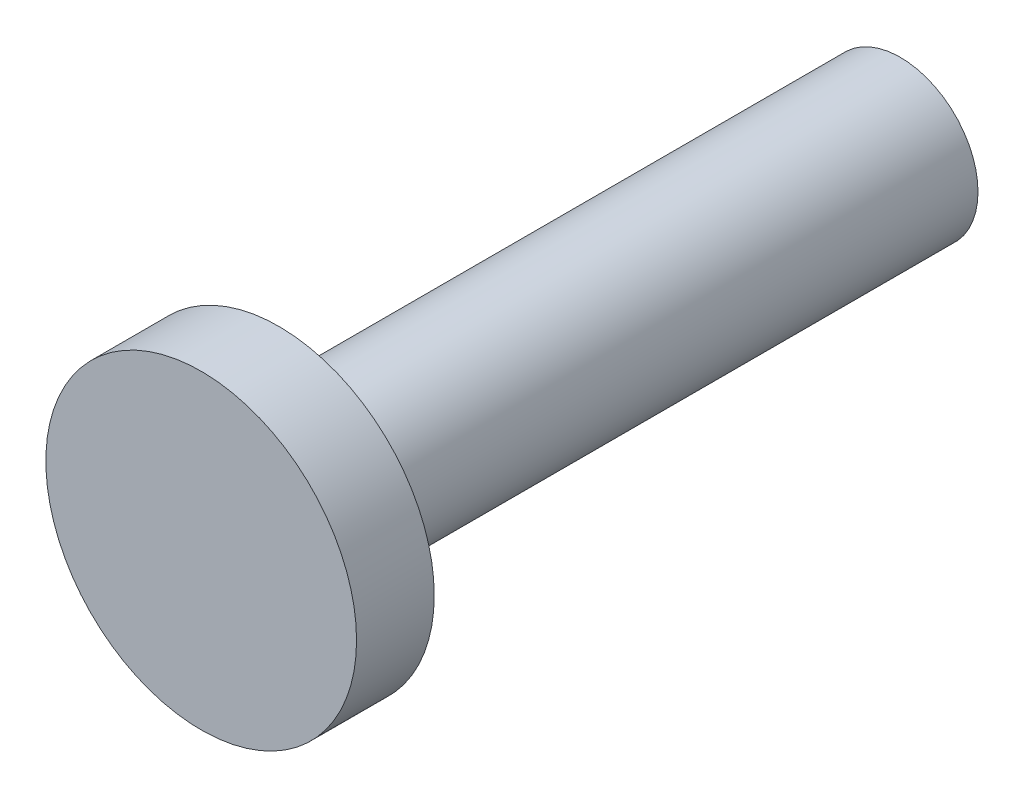
ISO-10303-21;
HEADER;
FILE_DESCRIPTION(('STEP AP214'),'2;1');
FILE_NAME('part.step','',(''),(''),'','','');
FILE_SCHEMA(('AUTOMOTIVE_DESIGN { 1 0 10303 214 1 1 1 1 }'));
ENDSEC;
DATA;
#1=APPLICATION_CONTEXT('core data for automotive mechanical design processes');
#2=APPLICATION_PROTOCOL_DEFINITION('international standard','automotive_design',2000,#1);
#3=PRODUCT_CONTEXT('',#1,'mechanical');
#4=PRODUCT('Part','Part','',(#3));
#5=PRODUCT_RELATED_PRODUCT_CATEGORY('part','',(#4));
#6=PRODUCT_DEFINITION_FORMATION('','',#4);
#7=PRODUCT_DEFINITION_CONTEXT('part definition',#1,'design');
#8=PRODUCT_DEFINITION('design','',#6,#7);
#9=PRODUCT_DEFINITION_SHAPE('','',#8);
#10=(LENGTH_UNIT() NAMED_UNIT(*) SI_UNIT(.MILLI.,.METRE.));
#11=(NAMED_UNIT(*) PLANE_ANGLE_UNIT() SI_UNIT($,.RADIAN.));
#12=(NAMED_UNIT(*) SI_UNIT($,.STERADIAN.) SOLID_ANGLE_UNIT());
#13=UNCERTAINTY_MEASURE_WITH_UNIT(LENGTH_MEASURE(1.E-05),#10,'distance_accuracy_value','');
#14=(GEOMETRIC_REPRESENTATION_CONTEXT(3) GLOBAL_UNCERTAINTY_ASSIGNED_CONTEXT((#13)) GLOBAL_UNIT_ASSIGNED_CONTEXT((#10,
#11,#12)) REPRESENTATION_CONTEXT('',''));
#15=CARTESIAN_POINT('',(0.,0.,0.));
#16=DIRECTION('',(0.,0.,1.));
#17=DIRECTION('',(1.,0.,0.));
#18=AXIS2_PLACEMENT_3D('',#15,#16,#17);
#19=CARTESIAN_POINT('',(0.,0.,8.));
#20=DIRECTION('',(0.,0.,-1.));
#21=DIRECTION('',(-1.,0.,0.));
#22=AXIS2_PLACEMENT_3D('',#19,#20,#21);
#23=CYLINDRICAL_SURFACE('',#22,1.);
#24=CARTESIAN_POINT('',(0.,0.,8.));
#25=DIRECTION('',(0.,0.,1.));
#26=DIRECTION('',(1.,0.,0.));
#27=AXIS2_PLACEMENT_3D('',#24,#25,#26);
#28=CIRCLE('',#27,1.);
#29=CARTESIAN_POINT('',(1.,0.,8.));
#30=VERTEX_POINT('',#29);
#31=EDGE_CURVE('E10',#30,#30,#28,.T.);
#32=ORIENTED_EDGE('',*,*,#31,.F.);
#33=EDGE_LOOP('',(#32));
#34=FACE_BOUND('',#33,.T.);
#35=CARTESIAN_POINT('',(0.,0.,0.));
#36=DIRECTION('',(0.,0.,1.));
#37=DIRECTION('',(1.,0.,0.));
#38=AXIS2_PLACEMENT_3D('',#35,#36,#37);
#39=CIRCLE('',#38,1.);
#40=CARTESIAN_POINT('',(1.,0.,0.));
#41=VERTEX_POINT('',#40);
#42=EDGE_CURVE('E34',#41,#41,#39,.T.);
#43=ORIENTED_EDGE('',*,*,#42,.T.);
#44=EDGE_LOOP('',(#43));
#45=FACE_BOUND('',#44,.T.);
#46=ADVANCED_FACE('F31',(#34,#45),#23,.T.);
#47=CARTESIAN_POINT('',(0.,0.,0.));
#48=DIRECTION('',(0.,0.,1.));
#49=DIRECTION('',(1.,0.,0.));
#50=AXIS2_PLACEMENT_3D('',#47,#48,#49);
#51=PLANE('',#50);
#52=ORIENTED_EDGE('',*,*,#42,.F.);
#53=EDGE_LOOP('',(#52));
#54=FACE_BOUND('',#53,.T.);
#55=ADVANCED_FACE('F54',(#54),#51,.F.);
#56=CARTESIAN_POINT('',(0.,0.,9.));
#57=DIRECTION('',(0.,0.,-1.));
#58=DIRECTION('',(-1.,0.,0.));
#59=AXIS2_PLACEMENT_3D('',#56,#57,#58);
#60=CYLINDRICAL_SURFACE('',#59,2.);
#61=CARTESIAN_POINT('',(0.,0.,9.));
#62=DIRECTION('',(0.,0.,1.));
#63=DIRECTION('',(1.,0.,0.));
#64=AXIS2_PLACEMENT_3D('',#61,#62,#63);
#65=CIRCLE('',#64,2.);
#66=CARTESIAN_POINT('',(2.,0.,9.));
#67=VERTEX_POINT('',#66);
#68=EDGE_CURVE('E41',#67,#67,#65,.T.);
#69=ORIENTED_EDGE('',*,*,#68,.F.);
#70=EDGE_LOOP('',(#69));
#71=FACE_BOUND('',#70,.T.);
#72=CARTESIAN_POINT('',(0.,0.,8.));
#73=DIRECTION('',(0.,0.,1.));
#74=DIRECTION('',(1.,0.,0.));
#75=AXIS2_PLACEMENT_3D('',#72,#73,#74);
#76=CIRCLE('',#75,2.);
#77=CARTESIAN_POINT('',(2.,0.,8.));
#78=VERTEX_POINT('',#77);
#79=EDGE_CURVE('E43',#78,#78,#76,.T.);
#80=ORIENTED_EDGE('',*,*,#79,.T.);
#81=EDGE_LOOP('',(#80));
#82=FACE_BOUND('',#81,.T.);
#83=ADVANCED_FACE('F51',(#71,#82),#60,.T.);
#84=CARTESIAN_POINT('',(0.,0.,9.));
#85=DIRECTION('',(0.,0.,1.));
#86=DIRECTION('',(1.,0.,0.));
#87=AXIS2_PLACEMENT_3D('',#84,#85,#86);
#88=PLANE('',#87);
#89=ORIENTED_EDGE('',*,*,#68,.T.);
#90=EDGE_LOOP('',(#89));
#91=FACE_BOUND('',#90,.T.);
#92=ADVANCED_FACE('F49',(#91),#88,.T.);
#93=CARTESIAN_POINT('',(0.,0.,8.));
#94=DIRECTION('',(0.,0.,1.));
#95=DIRECTION('',(1.,0.,0.));
#96=AXIS2_PLACEMENT_3D('',#93,#94,#95);
#97=PLANE('',#96);
#98=ORIENTED_EDGE('',*,*,#31,.T.);
#99=EDGE_LOOP('',(#98));
#100=FACE_BOUND('',#99,.T.);
#101=ORIENTED_EDGE('',*,*,#79,.F.);
#102=EDGE_LOOP('',(#101));
#103=FACE_BOUND('',#102,.T.);
#104=ADVANCED_FACE('F58',(#100,#103),#97,.F.);
#105=CLOSED_SHELL('',(#46,#55,#83,#92,#104));
#106=MANIFOLD_SOLID_BREP('B2',#105);
#107=ADVANCED_BREP_SHAPE_REPRESENTATION('',(#18,#106),#14);
#108=SHAPE_DEFINITION_REPRESENTATION(#9,#107);
ENDSEC;
END-ISO-10303-21;
